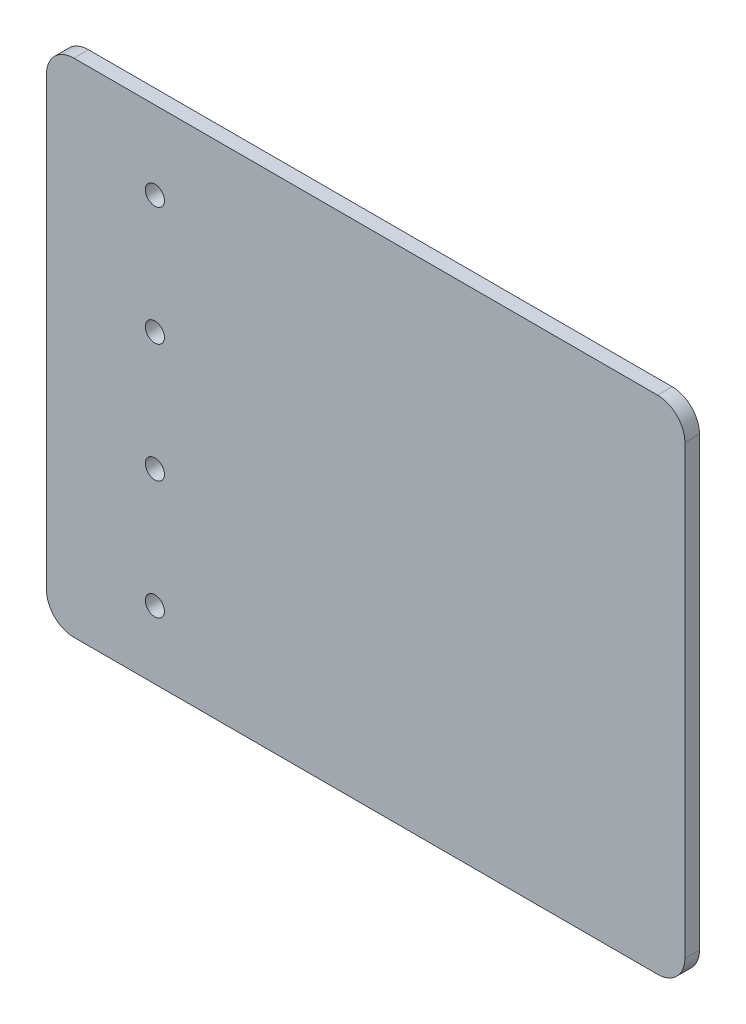
ISO-10303-21;
HEADER;
FILE_DESCRIPTION(('STEP AP214'),'2;1');
FILE_NAME('part.step','',(''),(''),'','','');
FILE_SCHEMA(('AUTOMOTIVE_DESIGN { 1 0 10303 214 1 1 1 1 }'));
ENDSEC;
DATA;
#1=APPLICATION_CONTEXT('core data for automotive mechanical design processes');
#2=APPLICATION_PROTOCOL_DEFINITION('international standard','automotive_design',2000,#1);
#3=PRODUCT_CONTEXT('',#1,'mechanical');
#4=PRODUCT('Part','Part','',(#3));
#5=PRODUCT_RELATED_PRODUCT_CATEGORY('part','',(#4));
#6=PRODUCT_DEFINITION_FORMATION('','',#4);
#7=PRODUCT_DEFINITION_CONTEXT('part definition',#1,'design');
#8=PRODUCT_DEFINITION('design','',#6,#7);
#9=PRODUCT_DEFINITION_SHAPE('','',#8);
#10=(LENGTH_UNIT() NAMED_UNIT(*) SI_UNIT(.MILLI.,.METRE.));
#11=(NAMED_UNIT(*) PLANE_ANGLE_UNIT() SI_UNIT($,.RADIAN.));
#12=(NAMED_UNIT(*) SI_UNIT($,.STERADIAN.) SOLID_ANGLE_UNIT());
#13=UNCERTAINTY_MEASURE_WITH_UNIT(LENGTH_MEASURE(1.E-05),#10,'distance_accuracy_value','');
#14=(GEOMETRIC_REPRESENTATION_CONTEXT(3) GLOBAL_UNCERTAINTY_ASSIGNED_CONTEXT((#13)) GLOBAL_UNIT_ASSIGNED_CONTEXT((#10,
#11,#12)) REPRESENTATION_CONTEXT('',''));
#15=CARTESIAN_POINT('',(0.,0.,0.));
#16=DIRECTION('',(0.,0.,1.));
#17=DIRECTION('',(1.,0.,0.));
#18=AXIS2_PLACEMENT_3D('',#15,#16,#17);
#19=CARTESIAN_POINT('',(35.,-27.5,1.6));
#20=DIRECTION('',(-1.,0.,0.));
#21=DIRECTION('',(0.,0.,1.));
#22=AXIS2_PLACEMENT_3D('',#19,#20,#21);
#23=PLANE('',#22);
#24=DIRECTION('',(0.,1.,0.));
#25=VECTOR('',#24,1.);
#26=CARTESIAN_POINT('',(35.,-27.5,1.6));
#27=LINE('',#26,#25);
#28=CARTESIAN_POINT('',(35.,-24.5,1.6));
#29=VERTEX_POINT('',#28);
#30=CARTESIAN_POINT('',(35.,24.5,1.6));
#31=VERTEX_POINT('',#30);
#32=EDGE_CURVE('E135',#29,#31,#27,.T.);
#33=ORIENTED_EDGE('',*,*,#32,.F.);
#34=DIRECTION('',(0.,0.,-1.));
#35=VECTOR('',#34,1.);
#36=CARTESIAN_POINT('',(35.,-24.5,1.6));
#37=LINE('',#36,#35);
#38=CARTESIAN_POINT('',(35.,-24.5,0.));
#39=VERTEX_POINT('',#38);
#40=EDGE_CURVE('E161',#29,#39,#37,.T.);
#41=ORIENTED_EDGE('',*,*,#40,.T.);
#42=DIRECTION('',(0.,1.,0.));
#43=VECTOR('',#42,1.);
#44=CARTESIAN_POINT('',(35.,-27.5,0.));
#45=LINE('',#44,#43);
#46=CARTESIAN_POINT('',(35.,24.5,0.));
#47=VERTEX_POINT('',#46);
#48=EDGE_CURVE('E167',#39,#47,#45,.T.);
#49=ORIENTED_EDGE('',*,*,#48,.T.);
#50=DIRECTION('',(0.,0.,-1.));
#51=VECTOR('',#50,1.);
#52=CARTESIAN_POINT('',(35.,24.5,1.6));
#53=LINE('',#52,#51);
#54=EDGE_CURVE('E159',#47,#31,#53,.F.);
#55=ORIENTED_EDGE('',*,*,#54,.T.);
#56=EDGE_LOOP('',(#33,#41,#49,#55));
#57=FACE_BOUND('',#56,.T.);
#58=ADVANCED_FACE('F43',(#57),#23,.F.);
#59=CARTESIAN_POINT('',(-35.,27.5,1.6));
#60=DIRECTION('',(0.,-1.,0.));
#61=DIRECTION('',(0.,0.,-1.));
#62=AXIS2_PLACEMENT_3D('',#59,#60,#61);
#63=PLANE('',#62);
#64=DIRECTION('',(-1.,0.,0.));
#65=VECTOR('',#64,1.);
#66=CARTESIAN_POINT('',(-35.,27.5,1.6));
#67=LINE('',#66,#65);
#68=CARTESIAN_POINT('',(32.,27.5,1.6));
#69=VERTEX_POINT('',#68);
#70=CARTESIAN_POINT('',(-32.,27.5,1.6));
#71=VERTEX_POINT('',#70);
#72=EDGE_CURVE('E138',#69,#71,#67,.T.);
#73=ORIENTED_EDGE('',*,*,#72,.F.);
#74=DIRECTION('',(0.,0.,-1.));
#75=VECTOR('',#74,1.);
#76=CARTESIAN_POINT('',(32.,27.5,1.6));
#77=LINE('',#76,#75);
#78=CARTESIAN_POINT('',(32.,27.5,0.));
#79=VERTEX_POINT('',#78);
#80=EDGE_CURVE('E11',#69,#79,#77,.T.);
#81=ORIENTED_EDGE('',*,*,#80,.T.);
#82=DIRECTION('',(-1.,0.,0.));
#83=VECTOR('',#82,1.);
#84=CARTESIAN_POINT('',(-35.,27.5,0.));
#85=LINE('',#84,#83);
#86=CARTESIAN_POINT('',(-32.,27.5,0.));
#87=VERTEX_POINT('',#86);
#88=EDGE_CURVE('E140',#79,#87,#85,.T.);
#89=ORIENTED_EDGE('',*,*,#88,.T.);
#90=DIRECTION('',(0.,0.,-1.));
#91=VECTOR('',#90,1.);
#92=CARTESIAN_POINT('',(-32.,27.5,1.6));
#93=LINE('',#92,#91);
#94=EDGE_CURVE('E51',#87,#71,#93,.F.);
#95=ORIENTED_EDGE('',*,*,#94,.T.);
#96=EDGE_LOOP('',(#73,#81,#89,#95));
#97=FACE_BOUND('',#96,.T.);
#98=ADVANCED_FACE('F233',(#97),#63,.F.);
#99=CARTESIAN_POINT('',(-35.,-27.5,1.6));
#100=DIRECTION('',(1.,0.,0.));
#101=DIRECTION('',(0.,0.,-1.));
#102=AXIS2_PLACEMENT_3D('',#99,#100,#101);
#103=PLANE('',#102);
#104=DIRECTION('',(0.,-1.,0.));
#105=VECTOR('',#104,1.);
#106=CARTESIAN_POINT('',(-35.,-27.5,0.));
#107=LINE('',#106,#105);
#108=CARTESIAN_POINT('',(-35.,24.5,0.));
#109=VERTEX_POINT('',#108);
#110=CARTESIAN_POINT('',(-35.,-24.5,0.));
#111=VERTEX_POINT('',#110);
#112=EDGE_CURVE('E136',#109,#111,#107,.T.);
#113=ORIENTED_EDGE('',*,*,#112,.T.);
#114=DIRECTION('',(0.,0.,-1.));
#115=VECTOR('',#114,1.);
#116=CARTESIAN_POINT('',(-35.,-24.5,1.6));
#117=LINE('',#116,#115);
#118=CARTESIAN_POINT('',(-35.,-24.5,1.6));
#119=VERTEX_POINT('',#118);
#120=EDGE_CURVE('E114',#111,#119,#117,.F.);
#121=ORIENTED_EDGE('',*,*,#120,.T.);
#122=DIRECTION('',(0.,-1.,0.));
#123=VECTOR('',#122,1.);
#124=CARTESIAN_POINT('',(-35.,-27.5,1.6));
#125=LINE('',#124,#123);
#126=CARTESIAN_POINT('',(-35.,24.5,1.6));
#127=VERTEX_POINT('',#126);
#128=EDGE_CURVE('E179',#127,#119,#125,.T.);
#129=ORIENTED_EDGE('',*,*,#128,.F.);
#130=DIRECTION('',(0.,0.,-1.));
#131=VECTOR('',#130,1.);
#132=CARTESIAN_POINT('',(-35.,24.5,1.6));
#133=LINE('',#132,#131);
#134=EDGE_CURVE('E119',#127,#109,#133,.T.);
#135=ORIENTED_EDGE('',*,*,#134,.T.);
#136=EDGE_LOOP('',(#113,#121,#129,#135));
#137=FACE_BOUND('',#136,.T.);
#138=ADVANCED_FACE('F238',(#137),#103,.F.);
#139=CARTESIAN_POINT('',(-35.,-27.5,1.6));
#140=DIRECTION('',(0.,1.,0.));
#141=DIRECTION('',(0.,0.,1.));
#142=AXIS2_PLACEMENT_3D('',#139,#140,#141);
#143=PLANE('',#142);
#144=DIRECTION('',(1.,0.,0.));
#145=VECTOR('',#144,1.);
#146=CARTESIAN_POINT('',(-35.,-27.5,1.6));
#147=LINE('',#146,#145);
#148=CARTESIAN_POINT('',(-32.,-27.5,1.6));
#149=VERTEX_POINT('',#148);
#150=CARTESIAN_POINT('',(32.,-27.5,1.6));
#151=VERTEX_POINT('',#150);
#152=EDGE_CURVE('E129',#149,#151,#147,.T.);
#153=ORIENTED_EDGE('',*,*,#152,.F.);
#154=DIRECTION('',(0.,0.,-1.));
#155=VECTOR('',#154,1.);
#156=CARTESIAN_POINT('',(-32.,-27.5,1.6));
#157=LINE('',#156,#155);
#158=CARTESIAN_POINT('',(-32.,-27.5,0.));
#159=VERTEX_POINT('',#158);
#160=EDGE_CURVE('E113',#149,#159,#157,.T.);
#161=ORIENTED_EDGE('',*,*,#160,.T.);
#162=DIRECTION('',(1.,0.,0.));
#163=VECTOR('',#162,1.);
#164=CARTESIAN_POINT('',(-35.,-27.5,0.));
#165=LINE('',#164,#163);
#166=CARTESIAN_POINT('',(32.,-27.5,0.));
#167=VERTEX_POINT('',#166);
#168=EDGE_CURVE('E126',#159,#167,#165,.T.);
#169=ORIENTED_EDGE('',*,*,#168,.T.);
#170=DIRECTION('',(0.,0.,-1.));
#171=VECTOR('',#170,1.);
#172=CARTESIAN_POINT('',(32.,-27.5,1.6));
#173=LINE('',#172,#171);
#174=EDGE_CURVE('E131',#167,#151,#173,.F.);
#175=ORIENTED_EDGE('',*,*,#174,.T.);
#176=EDGE_LOOP('',(#153,#161,#169,#175));
#177=FACE_BOUND('',#176,.T.);
#178=ADVANCED_FACE('F125',(#177),#143,.F.);
#179=CARTESIAN_POINT('',(0.,0.,1.6));
#180=DIRECTION('',(0.,0.,-1.));
#181=DIRECTION('',(-1.,0.,0.));
#182=AXIS2_PLACEMENT_3D('',#179,#180,#181);
#183=PLANE('',#182);
#184=CARTESIAN_POINT('',(-23.118003477685,-20.06669,1.6));
#185=DIRECTION('',(0.,0.,-1.));
#186=DIRECTION('',(-1.,0.,0.));
#187=AXIS2_PLACEMENT_3D('',#184,#185,#186);
#188=CIRCLE('',#187,1.04999999999999);
#189=CARTESIAN_POINT('',(-24.168003477685,-20.06669,1.6));
#190=VERTEX_POINT('',#189);
#191=EDGE_CURVE('E172',#190,#190,#188,.T.);
#192=ORIENTED_EDGE('',*,*,#191,.T.);
#193=EDGE_LOOP('',(#192));
#194=FACE_BOUND('',#193,.T.);
#195=CARTESIAN_POINT('',(-23.118003477685,-7.06668999999999,1.6));
#196=DIRECTION('',(0.,0.,-1.));
#197=DIRECTION('',(-1.,0.,0.));
#198=AXIS2_PLACEMENT_3D('',#195,#196,#197);
#199=CIRCLE('',#198,1.04999999999999);
#200=CARTESIAN_POINT('',(-24.168003477685,-7.06668999999999,1.6));
#201=VERTEX_POINT('',#200);
#202=EDGE_CURVE('E198',#201,#201,#199,.T.);
#203=ORIENTED_EDGE('',*,*,#202,.T.);
#204=EDGE_LOOP('',(#203));
#205=FACE_BOUND('',#204,.T.);
#206=CARTESIAN_POINT('',(-23.118003477685,5.93331,1.6));
#207=DIRECTION('',(0.,0.,-1.));
#208=DIRECTION('',(-1.,0.,0.));
#209=AXIS2_PLACEMENT_3D('',#206,#207,#208);
#210=CIRCLE('',#209,1.04999999999999);
#211=CARTESIAN_POINT('',(-24.168003477685,5.93331,1.6));
#212=VERTEX_POINT('',#211);
#213=EDGE_CURVE('E192',#212,#212,#210,.T.);
#214=ORIENTED_EDGE('',*,*,#213,.T.);
#215=EDGE_LOOP('',(#214));
#216=FACE_BOUND('',#215,.T.);
#217=CARTESIAN_POINT('',(-23.118003477685,18.93331,1.6));
#218=DIRECTION('',(0.,0.,-1.));
#219=DIRECTION('',(-1.,0.,0.));
#220=AXIS2_PLACEMENT_3D('',#217,#218,#219);
#221=CIRCLE('',#220,1.04999999999999);
#222=CARTESIAN_POINT('',(-24.168003477685,18.93331,1.6));
#223=VERTEX_POINT('',#222);
#224=EDGE_CURVE('E186',#223,#223,#221,.T.);
#225=ORIENTED_EDGE('',*,*,#224,.T.);
#226=EDGE_LOOP('',(#225));
#227=FACE_BOUND('',#226,.T.);
#228=ORIENTED_EDGE('',*,*,#128,.T.);
#229=CARTESIAN_POINT('',(-32.,-24.5,1.6));
#230=DIRECTION('',(0.,0.,-1.));
#231=DIRECTION('',(-1.,0.,0.));
#232=AXIS2_PLACEMENT_3D('',#229,#230,#231);
#233=CIRCLE('',#232,3.);
#234=EDGE_CURVE('E157',#119,#149,#233,.F.);
#235=ORIENTED_EDGE('',*,*,#234,.T.);
#236=ORIENTED_EDGE('',*,*,#152,.T.);
#237=CARTESIAN_POINT('',(32.,-24.5,1.6));
#238=DIRECTION('',(0.,0.,-1.));
#239=DIRECTION('',(-1.,0.,0.));
#240=AXIS2_PLACEMENT_3D('',#237,#238,#239);
#241=CIRCLE('',#240,3.);
#242=EDGE_CURVE('E155',#151,#29,#241,.F.);
#243=ORIENTED_EDGE('',*,*,#242,.T.);
#244=ORIENTED_EDGE('',*,*,#32,.T.);
#245=CARTESIAN_POINT('',(32.,24.5,1.6));
#246=DIRECTION('',(0.,0.,-1.));
#247=DIRECTION('',(-1.,0.,0.));
#248=AXIS2_PLACEMENT_3D('',#245,#246,#247);
#249=CIRCLE('',#248,3.);
#250=EDGE_CURVE('E64',#31,#69,#249,.F.);
#251=ORIENTED_EDGE('',*,*,#250,.T.);
#252=ORIENTED_EDGE('',*,*,#72,.T.);
#253=CARTESIAN_POINT('',(-32.,24.5,1.6));
#254=DIRECTION('',(0.,0.,-1.));
#255=DIRECTION('',(-1.,0.,0.));
#256=AXIS2_PLACEMENT_3D('',#253,#254,#255);
#257=CIRCLE('',#256,3.);
#258=EDGE_CURVE('E152',#71,#127,#257,.F.);
#259=ORIENTED_EDGE('',*,*,#258,.T.);
#260=EDGE_LOOP('',(#228,#235,#236,#243,#244,#251,#252,#259));
#261=FACE_BOUND('',#260,.T.);
#262=ADVANCED_FACE('F208',(#194,#205,#216,#227,#261),#183,.F.);
#263=CARTESIAN_POINT('',(0.,0.,0.));
#264=DIRECTION('',(0.,0.,-1.));
#265=DIRECTION('',(-1.,0.,0.));
#266=AXIS2_PLACEMENT_3D('',#263,#264,#265);
#267=PLANE('',#266);
#268=CARTESIAN_POINT('',(-23.118003477685,-20.06669,0.));
#269=DIRECTION('',(0.,0.,-1.));
#270=DIRECTION('',(-1.,0.,0.));
#271=AXIS2_PLACEMENT_3D('',#268,#269,#270);
#272=CIRCLE('',#271,1.04999999999999);
#273=CARTESIAN_POINT('',(-24.168003477685,-20.06669,0.));
#274=VERTEX_POINT('',#273);
#275=EDGE_CURVE('E175',#274,#274,#272,.T.);
#276=ORIENTED_EDGE('',*,*,#275,.F.);
#277=EDGE_LOOP('',(#276));
#278=FACE_BOUND('',#277,.T.);
#279=CARTESIAN_POINT('',(-23.118003477685,-7.06668999999999,0.));
#280=DIRECTION('',(0.,0.,-1.));
#281=DIRECTION('',(-1.,0.,0.));
#282=AXIS2_PLACEMENT_3D('',#279,#280,#281);
#283=CIRCLE('',#282,1.04999999999999);
#284=CARTESIAN_POINT('',(-24.168003477685,-7.06668999999999,0.));
#285=VERTEX_POINT('',#284);
#286=EDGE_CURVE('E195',#285,#285,#283,.T.);
#287=ORIENTED_EDGE('',*,*,#286,.F.);
#288=EDGE_LOOP('',(#287));
#289=FACE_BOUND('',#288,.T.);
#290=CARTESIAN_POINT('',(-23.118003477685,5.93331,0.));
#291=DIRECTION('',(0.,0.,-1.));
#292=DIRECTION('',(-1.,0.,0.));
#293=AXIS2_PLACEMENT_3D('',#290,#291,#292);
#294=CIRCLE('',#293,1.04999999999999);
#295=CARTESIAN_POINT('',(-24.168003477685,5.93331,0.));
#296=VERTEX_POINT('',#295);
#297=EDGE_CURVE('E189',#296,#296,#294,.T.);
#298=ORIENTED_EDGE('',*,*,#297,.F.);
#299=EDGE_LOOP('',(#298));
#300=FACE_BOUND('',#299,.T.);
#301=CARTESIAN_POINT('',(-23.118003477685,18.93331,0.));
#302=DIRECTION('',(0.,0.,-1.));
#303=DIRECTION('',(-1.,0.,0.));
#304=AXIS2_PLACEMENT_3D('',#301,#302,#303);
#305=CIRCLE('',#304,1.04999999999999);
#306=CARTESIAN_POINT('',(-24.168003477685,18.93331,0.));
#307=VERTEX_POINT('',#306);
#308=EDGE_CURVE('E183',#307,#307,#305,.T.);
#309=ORIENTED_EDGE('',*,*,#308,.F.);
#310=EDGE_LOOP('',(#309));
#311=FACE_BOUND('',#310,.T.);
#312=ORIENTED_EDGE('',*,*,#168,.F.);
#313=CARTESIAN_POINT('',(-32.,-24.5,0.));
#314=DIRECTION('',(0.,0.,-1.));
#315=DIRECTION('',(-1.,0.,0.));
#316=AXIS2_PLACEMENT_3D('',#313,#314,#315);
#317=CIRCLE('',#316,3.);
#318=EDGE_CURVE('E109',#159,#111,#317,.T.);
#319=ORIENTED_EDGE('',*,*,#318,.T.);
#320=ORIENTED_EDGE('',*,*,#112,.F.);
#321=CARTESIAN_POINT('',(-32.,24.5,0.));
#322=DIRECTION('',(0.,0.,-1.));
#323=DIRECTION('',(-1.,0.,0.));
#324=AXIS2_PLACEMENT_3D('',#321,#322,#323);
#325=CIRCLE('',#324,3.);
#326=EDGE_CURVE('E130',#109,#87,#325,.T.);
#327=ORIENTED_EDGE('',*,*,#326,.T.);
#328=ORIENTED_EDGE('',*,*,#88,.F.);
#329=CARTESIAN_POINT('',(32.,24.5,0.));
#330=DIRECTION('',(0.,0.,-1.));
#331=DIRECTION('',(-1.,0.,0.));
#332=AXIS2_PLACEMENT_3D('',#329,#330,#331);
#333=CIRCLE('',#332,3.);
#334=EDGE_CURVE('E146',#79,#47,#333,.T.);
#335=ORIENTED_EDGE('',*,*,#334,.T.);
#336=ORIENTED_EDGE('',*,*,#48,.F.);
#337=CARTESIAN_POINT('',(32.,-24.5,0.));
#338=DIRECTION('',(0.,0.,-1.));
#339=DIRECTION('',(-1.,0.,0.));
#340=AXIS2_PLACEMENT_3D('',#337,#338,#339);
#341=CIRCLE('',#340,3.);
#342=EDGE_CURVE('E120',#39,#167,#341,.T.);
#343=ORIENTED_EDGE('',*,*,#342,.T.);
#344=EDGE_LOOP('',(#312,#319,#320,#327,#328,#335,#336,#343));
#345=FACE_BOUND('',#344,.T.);
#346=ADVANCED_FACE('F133',(#278,#289,#300,#311,#345),#267,.T.);
#347=CARTESIAN_POINT('',(-32.,-24.5,1.6));
#348=DIRECTION('',(0.,0.,-1.));
#349=DIRECTION('',(-1.,0.,0.));
#350=AXIS2_PLACEMENT_3D('',#347,#348,#349);
#351=CYLINDRICAL_SURFACE('',#350,3.);
#352=ORIENTED_EDGE('',*,*,#234,.F.);
#353=ORIENTED_EDGE('',*,*,#120,.F.);
#354=ORIENTED_EDGE('',*,*,#318,.F.);
#355=ORIENTED_EDGE('',*,*,#160,.F.);
#356=EDGE_LOOP('',(#352,#353,#354,#355));
#357=FACE_BOUND('',#356,.T.);
#358=ADVANCED_FACE('F112',(#357),#351,.T.);
#359=CARTESIAN_POINT('',(32.,-24.5,1.6));
#360=DIRECTION('',(0.,0.,-1.));
#361=DIRECTION('',(-1.,0.,0.));
#362=AXIS2_PLACEMENT_3D('',#359,#360,#361);
#363=CYLINDRICAL_SURFACE('',#362,3.);
#364=ORIENTED_EDGE('',*,*,#242,.F.);
#365=ORIENTED_EDGE('',*,*,#174,.F.);
#366=ORIENTED_EDGE('',*,*,#342,.F.);
#367=ORIENTED_EDGE('',*,*,#40,.F.);
#368=EDGE_LOOP('',(#364,#365,#366,#367));
#369=FACE_BOUND('',#368,.T.);
#370=ADVANCED_FACE('F244',(#369),#363,.T.);
#371=CARTESIAN_POINT('',(32.,24.5,1.6));
#372=DIRECTION('',(0.,0.,-1.));
#373=DIRECTION('',(-1.,0.,0.));
#374=AXIS2_PLACEMENT_3D('',#371,#372,#373);
#375=CYLINDRICAL_SURFACE('',#374,3.);
#376=ORIENTED_EDGE('',*,*,#250,.F.);
#377=ORIENTED_EDGE('',*,*,#54,.F.);
#378=ORIENTED_EDGE('',*,*,#334,.F.);
#379=ORIENTED_EDGE('',*,*,#80,.F.);
#380=EDGE_LOOP('',(#376,#377,#378,#379));
#381=FACE_BOUND('',#380,.T.);
#382=ADVANCED_FACE('F228',(#381),#375,.T.);
#383=CARTESIAN_POINT('',(-32.,24.5,1.6));
#384=DIRECTION('',(0.,0.,-1.));
#385=DIRECTION('',(-1.,0.,0.));
#386=AXIS2_PLACEMENT_3D('',#383,#384,#385);
#387=CYLINDRICAL_SURFACE('',#386,3.);
#388=ORIENTED_EDGE('',*,*,#258,.F.);
#389=ORIENTED_EDGE('',*,*,#94,.F.);
#390=ORIENTED_EDGE('',*,*,#326,.F.);
#391=ORIENTED_EDGE('',*,*,#134,.F.);
#392=EDGE_LOOP('',(#388,#389,#390,#391));
#393=FACE_BOUND('',#392,.T.);
#394=ADVANCED_FACE('F45',(#393),#387,.T.);
#395=CARTESIAN_POINT('',(-23.118003477685,18.93331,1.6));
#396=DIRECTION('',(0.,0.,-1.));
#397=DIRECTION('',(-1.,0.,0.));
#398=AXIS2_PLACEMENT_3D('',#395,#396,#397);
#399=CYLINDRICAL_SURFACE('',#398,1.04999999999999);
#400=ORIENTED_EDGE('',*,*,#224,.F.);
#401=EDGE_LOOP('',(#400));
#402=FACE_BOUND('',#401,.T.);
#403=ORIENTED_EDGE('',*,*,#308,.T.);
#404=EDGE_LOOP('',(#403));
#405=FACE_BOUND('',#404,.T.);
#406=ADVANCED_FACE('F216',(#402,#405),#399,.F.);
#407=CARTESIAN_POINT('',(-23.118003477685,5.93331,1.6));
#408=DIRECTION('',(0.,0.,-1.));
#409=DIRECTION('',(-1.,0.,0.));
#410=AXIS2_PLACEMENT_3D('',#407,#408,#409);
#411=CYLINDRICAL_SURFACE('',#410,1.04999999999999);
#412=ORIENTED_EDGE('',*,*,#213,.F.);
#413=EDGE_LOOP('',(#412));
#414=FACE_BOUND('',#413,.T.);
#415=ORIENTED_EDGE('',*,*,#297,.T.);
#416=EDGE_LOOP('',(#415));
#417=FACE_BOUND('',#416,.T.);
#418=ADVANCED_FACE('F218',(#414,#417),#411,.F.);
#419=CARTESIAN_POINT('',(-23.118003477685,-7.06668999999999,1.6));
#420=DIRECTION('',(0.,0.,-1.));
#421=DIRECTION('',(-1.,0.,0.));
#422=AXIS2_PLACEMENT_3D('',#419,#420,#421);
#423=CYLINDRICAL_SURFACE('',#422,1.04999999999999);
#424=ORIENTED_EDGE('',*,*,#202,.F.);
#425=EDGE_LOOP('',(#424));
#426=FACE_BOUND('',#425,.T.);
#427=ORIENTED_EDGE('',*,*,#286,.T.);
#428=EDGE_LOOP('',(#427));
#429=FACE_BOUND('',#428,.T.);
#430=ADVANCED_FACE('F225',(#426,#429),#423,.F.);
#431=CARTESIAN_POINT('',(-23.118003477685,-20.06669,1.6));
#432=DIRECTION('',(0.,0.,-1.));
#433=DIRECTION('',(-1.,0.,0.));
#434=AXIS2_PLACEMENT_3D('',#431,#432,#433);
#435=CYLINDRICAL_SURFACE('',#434,1.04999999999999);
#436=ORIENTED_EDGE('',*,*,#191,.F.);
#437=EDGE_LOOP('',(#436));
#438=FACE_BOUND('',#437,.T.);
#439=ORIENTED_EDGE('',*,*,#275,.T.);
#440=EDGE_LOOP('',(#439));
#441=FACE_BOUND('',#440,.T.);
#442=ADVANCED_FACE('F204',(#438,#441),#435,.F.);
#443=CLOSED_SHELL('',(#58,#98,#138,#178,#262,#346,#358,#370,#382,#394,#406,#418,#430,#442));
#444=MANIFOLD_SOLID_BREP('B2',#443);
#445=ADVANCED_BREP_SHAPE_REPRESENTATION('',(#18,#444),#14);
#446=SHAPE_DEFINITION_REPRESENTATION(#9,#445);
ENDSEC;
END-ISO-10303-21;
